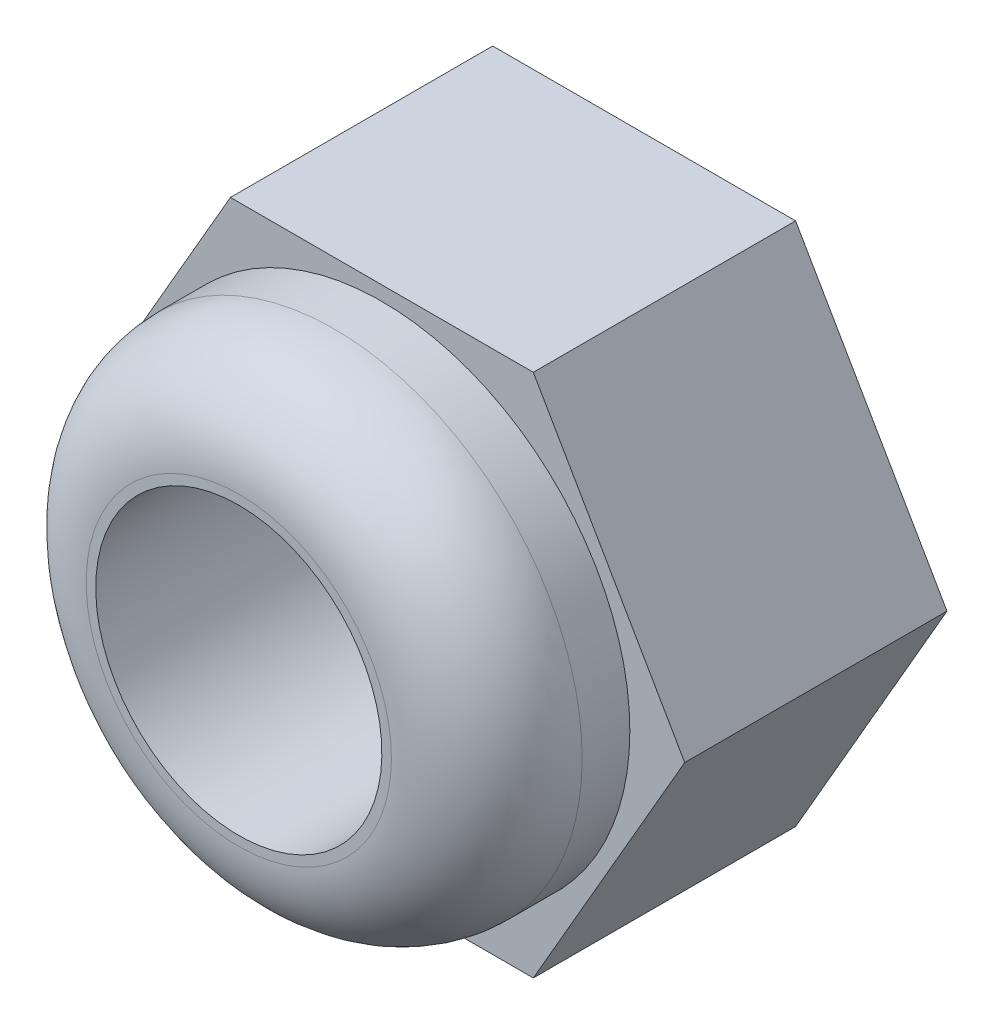
ISO-10303-21;
HEADER;
FILE_DESCRIPTION(('STEP AP214'),'2;1');
FILE_NAME('part.step','',(''),(''),'','','');
FILE_SCHEMA(('AUTOMOTIVE_DESIGN { 1 0 10303 214 1 1 1 1 }'));
ENDSEC;
DATA;
#1=APPLICATION_CONTEXT('core data for automotive mechanical design processes');
#2=APPLICATION_PROTOCOL_DEFINITION('international standard','automotive_design',2000,#1);
#3=PRODUCT_CONTEXT('',#1,'mechanical');
#4=PRODUCT('Part','Part','',(#3));
#5=PRODUCT_RELATED_PRODUCT_CATEGORY('part','',(#4));
#6=PRODUCT_DEFINITION_FORMATION('','',#4);
#7=PRODUCT_DEFINITION_CONTEXT('part definition',#1,'design');
#8=PRODUCT_DEFINITION('design','',#6,#7);
#9=PRODUCT_DEFINITION_SHAPE('','',#8);
#10=(LENGTH_UNIT() NAMED_UNIT(*) SI_UNIT(.MILLI.,.METRE.));
#11=(NAMED_UNIT(*) PLANE_ANGLE_UNIT() SI_UNIT($,.RADIAN.));
#12=(NAMED_UNIT(*) SI_UNIT($,.STERADIAN.) SOLID_ANGLE_UNIT());
#13=UNCERTAINTY_MEASURE_WITH_UNIT(LENGTH_MEASURE(1.E-05),#10,'distance_accuracy_value','');
#14=(GEOMETRIC_REPRESENTATION_CONTEXT(3) GLOBAL_UNCERTAINTY_ASSIGNED_CONTEXT((#13)) GLOBAL_UNIT_ASSIGNED_CONTEXT((#10,
#11,#12)) REPRESENTATION_CONTEXT('',''));
#15=CARTESIAN_POINT('',(0.,0.,0.));
#16=DIRECTION('',(0.,0.,1.));
#17=DIRECTION('',(1.,0.,0.));
#18=AXIS2_PLACEMENT_3D('',#15,#16,#17);
#19=CARTESIAN_POINT('',(-1.58771324027147,-2.75,0.));
#20=DIRECTION('',(0.,-1.,0.));
#21=DIRECTION('',(1.,0.,0.));
#22=AXIS2_PLACEMENT_3D('',#19,#20,#21);
#23=PLANE('',#22);
#24=DIRECTION('',(1.,0.,0.));
#25=VECTOR('',#24,1.);
#26=CARTESIAN_POINT('',(-1.58771324027147,-2.75,2.75));
#27=LINE('',#26,#25);
#28=CARTESIAN_POINT('',(-1.58771324027147,-2.75,2.75));
#29=VERTEX_POINT('',#28);
#30=CARTESIAN_POINT('',(1.58771324027147,-2.75,2.75));
#31=VERTEX_POINT('',#30);
#32=EDGE_CURVE('E120',#29,#31,#27,.T.);
#33=ORIENTED_EDGE('',*,*,#32,.F.);
#34=DIRECTION('',(0.,0.,1.));
#35=VECTOR('',#34,1.);
#36=CARTESIAN_POINT('',(-1.58771324027147,-2.75,0.));
#37=LINE('',#36,#35);
#38=CARTESIAN_POINT('',(-1.58771324027147,-2.75,0.));
#39=VERTEX_POINT('',#38);
#40=EDGE_CURVE('E49',#39,#29,#37,.T.);
#41=ORIENTED_EDGE('',*,*,#40,.F.);
#42=DIRECTION('',(1.,0.,0.));
#43=VECTOR('',#42,1.);
#44=CARTESIAN_POINT('',(-1.58771324027147,-2.75,0.));
#45=LINE('',#44,#43);
#46=CARTESIAN_POINT('',(1.58771324027147,-2.75,0.));
#47=VERTEX_POINT('',#46);
#48=EDGE_CURVE('E136',#39,#47,#45,.T.);
#49=ORIENTED_EDGE('',*,*,#48,.T.);
#50=DIRECTION('',(0.,0.,1.));
#51=VECTOR('',#50,1.);
#52=CARTESIAN_POINT('',(1.58771324027147,-2.75,0.));
#53=LINE('',#52,#51);
#54=EDGE_CURVE('E84',#47,#31,#53,.T.);
#55=ORIENTED_EDGE('',*,*,#54,.T.);
#56=EDGE_LOOP('',(#33,#41,#49,#55));
#57=FACE_BOUND('',#56,.T.);
#58=ADVANCED_FACE('F32',(#57),#23,.T.);
#59=CARTESIAN_POINT('',(-3.17542648054294,0.,0.));
#60=DIRECTION('',(-0.866025403784438,-0.500000000000001,0.));
#61=DIRECTION('',(0.500000000000001,-0.866025403784438,0.));
#62=AXIS2_PLACEMENT_3D('',#59,#60,#61);
#63=PLANE('',#62);
#64=DIRECTION('',(0.500000000000001,-0.866025403784438,0.));
#65=VECTOR('',#64,1.);
#66=CARTESIAN_POINT('',(-3.17542648054294,0.,2.75));
#67=LINE('',#66,#65);
#68=CARTESIAN_POINT('',(-3.17542648054294,0.,2.75));
#69=VERTEX_POINT('',#68);
#70=EDGE_CURVE('E133',#69,#29,#67,.T.);
#71=ORIENTED_EDGE('',*,*,#70,.F.);
#72=DIRECTION('',(0.,0.,1.));
#73=VECTOR('',#72,1.);
#74=CARTESIAN_POINT('',(-3.17542648054294,0.,0.));
#75=LINE('',#74,#73);
#76=CARTESIAN_POINT('',(-3.17542648054294,0.,0.));
#77=VERTEX_POINT('',#76);
#78=EDGE_CURVE('E72',#77,#69,#75,.T.);
#79=ORIENTED_EDGE('',*,*,#78,.F.);
#80=DIRECTION('',(0.500000000000001,-0.866025403784438,0.));
#81=VECTOR('',#80,1.);
#82=CARTESIAN_POINT('',(-3.17542648054294,0.,0.));
#83=LINE('',#82,#81);
#84=EDGE_CURVE('E110',#77,#39,#83,.T.);
#85=ORIENTED_EDGE('',*,*,#84,.T.);
#86=ORIENTED_EDGE('',*,*,#40,.T.);
#87=EDGE_LOOP('',(#71,#79,#85,#86));
#88=FACE_BOUND('',#87,.T.);
#89=ADVANCED_FACE('F161',(#88),#63,.T.);
#90=CARTESIAN_POINT('',(-1.58771324027147,2.75,0.));
#91=DIRECTION('',(-0.866025403784439,0.499999999999999,0.));
#92=DIRECTION('',(-0.499999999999999,-0.866025403784439,0.));
#93=AXIS2_PLACEMENT_3D('',#90,#91,#92);
#94=PLANE('',#93);
#95=DIRECTION('',(-0.499999999999999,-0.866025403784439,0.));
#96=VECTOR('',#95,1.);
#97=CARTESIAN_POINT('',(-1.58771324027147,2.75,2.75));
#98=LINE('',#97,#96);
#99=CARTESIAN_POINT('',(-1.58771324027147,2.75,2.75));
#100=VERTEX_POINT('',#99);
#101=EDGE_CURVE('E97',#100,#69,#98,.T.);
#102=ORIENTED_EDGE('',*,*,#101,.F.);
#103=DIRECTION('',(0.,0.,1.));
#104=VECTOR('',#103,1.);
#105=CARTESIAN_POINT('',(-1.58771324027147,2.75,0.));
#106=LINE('',#105,#104);
#107=CARTESIAN_POINT('',(-1.58771324027147,2.75,0.));
#108=VERTEX_POINT('',#107);
#109=EDGE_CURVE('E92',#108,#100,#106,.T.);
#110=ORIENTED_EDGE('',*,*,#109,.F.);
#111=DIRECTION('',(-0.499999999999999,-0.866025403784439,0.));
#112=VECTOR('',#111,1.);
#113=CARTESIAN_POINT('',(-1.58771324027147,2.75,0.));
#114=LINE('',#113,#112);
#115=EDGE_CURVE('E95',#108,#77,#114,.T.);
#116=ORIENTED_EDGE('',*,*,#115,.T.);
#117=ORIENTED_EDGE('',*,*,#78,.T.);
#118=EDGE_LOOP('',(#102,#110,#116,#117));
#119=FACE_BOUND('',#118,.T.);
#120=ADVANCED_FACE('F94',(#119),#94,.T.);
#121=CARTESIAN_POINT('',(1.58771324027147,2.75,0.));
#122=DIRECTION('',(0.,1.,0.));
#123=DIRECTION('',(-1.,0.,0.));
#124=AXIS2_PLACEMENT_3D('',#121,#122,#123);
#125=PLANE('',#124);
#126=DIRECTION('',(-1.,0.,0.));
#127=VECTOR('',#126,1.);
#128=CARTESIAN_POINT('',(1.58771324027147,2.75,2.75));
#129=LINE('',#128,#127);
#130=CARTESIAN_POINT('',(1.58771324027147,2.75,2.75));
#131=VERTEX_POINT('',#130);
#132=EDGE_CURVE('E130',#131,#100,#129,.T.);
#133=ORIENTED_EDGE('',*,*,#132,.F.);
#134=DIRECTION('',(0.,0.,1.));
#135=VECTOR('',#134,1.);
#136=CARTESIAN_POINT('',(1.58771324027147,2.75,0.));
#137=LINE('',#136,#135);
#138=CARTESIAN_POINT('',(1.58771324027147,2.75,0.));
#139=VERTEX_POINT('',#138);
#140=EDGE_CURVE('E102',#139,#131,#137,.T.);
#141=ORIENTED_EDGE('',*,*,#140,.F.);
#142=DIRECTION('',(-1.,0.,0.));
#143=VECTOR('',#142,1.);
#144=CARTESIAN_POINT('',(1.58771324027147,2.75,0.));
#145=LINE('',#144,#143);
#146=EDGE_CURVE('E108',#139,#108,#145,.T.);
#147=ORIENTED_EDGE('',*,*,#146,.T.);
#148=ORIENTED_EDGE('',*,*,#109,.T.);
#149=EDGE_LOOP('',(#133,#141,#147,#148));
#150=FACE_BOUND('',#149,.T.);
#151=ADVANCED_FACE('F112',(#150),#125,.T.);
#152=CARTESIAN_POINT('',(3.17542648054294,0.,0.));
#153=DIRECTION('',(0.866025403784438,0.500000000000001,0.));
#154=DIRECTION('',(-0.500000000000001,0.866025403784438,0.));
#155=AXIS2_PLACEMENT_3D('',#152,#153,#154);
#156=PLANE('',#155);
#157=DIRECTION('',(-0.500000000000001,0.866025403784438,0.));
#158=VECTOR('',#157,1.);
#159=CARTESIAN_POINT('',(3.17542648054294,0.,2.75));
#160=LINE('',#159,#158);
#161=CARTESIAN_POINT('',(3.17542648054294,0.,2.75));
#162=VERTEX_POINT('',#161);
#163=EDGE_CURVE('E127',#162,#131,#160,.T.);
#164=ORIENTED_EDGE('',*,*,#163,.F.);
#165=DIRECTION('',(0.,0.,1.));
#166=VECTOR('',#165,1.);
#167=CARTESIAN_POINT('',(3.17542648054294,0.,0.));
#168=LINE('',#167,#166);
#169=CARTESIAN_POINT('',(3.17542648054294,0.,0.));
#170=VERTEX_POINT('',#169);
#171=EDGE_CURVE('E141',#170,#162,#168,.T.);
#172=ORIENTED_EDGE('',*,*,#171,.F.);
#173=DIRECTION('',(-0.500000000000001,0.866025403784438,0.));
#174=VECTOR('',#173,1.);
#175=CARTESIAN_POINT('',(3.17542648054294,0.,0.));
#176=LINE('',#175,#174);
#177=EDGE_CURVE('E113',#170,#139,#176,.T.);
#178=ORIENTED_EDGE('',*,*,#177,.T.);
#179=ORIENTED_EDGE('',*,*,#140,.T.);
#180=EDGE_LOOP('',(#164,#172,#178,#179));
#181=FACE_BOUND('',#180,.T.);
#182=ADVANCED_FACE('F170',(#181),#156,.T.);
#183=CARTESIAN_POINT('',(1.58771324027147,-2.75,0.));
#184=DIRECTION('',(0.866025403784439,-0.5,0.));
#185=DIRECTION('',(0.5,0.866025403784439,0.));
#186=AXIS2_PLACEMENT_3D('',#183,#184,#185);
#187=PLANE('',#186);
#188=DIRECTION('',(0.5,0.866025403784439,0.));
#189=VECTOR('',#188,1.);
#190=CARTESIAN_POINT('',(1.58771324027147,-2.75,2.75));
#191=LINE('',#190,#189);
#192=EDGE_CURVE('E123',#31,#162,#191,.T.);
#193=ORIENTED_EDGE('',*,*,#192,.F.);
#194=ORIENTED_EDGE('',*,*,#54,.F.);
#195=DIRECTION('',(0.5,0.866025403784439,0.));
#196=VECTOR('',#195,1.);
#197=CARTESIAN_POINT('',(1.58771324027147,-2.75,0.));
#198=LINE('',#197,#196);
#199=EDGE_CURVE('E115',#47,#170,#198,.T.);
#200=ORIENTED_EDGE('',*,*,#199,.T.);
#201=ORIENTED_EDGE('',*,*,#171,.T.);
#202=EDGE_LOOP('',(#193,#194,#200,#201));
#203=FACE_BOUND('',#202,.T.);
#204=ADVANCED_FACE('F167',(#203),#187,.T.);
#205=CARTESIAN_POINT('',(0.,0.,0.));
#206=DIRECTION('',(0.,0.,1.));
#207=DIRECTION('',(1.,0.,0.));
#208=AXIS2_PLACEMENT_3D('',#205,#206,#207);
#209=PLANE('',#208);
#210=CARTESIAN_POINT('',(0.,0.,0.));
#211=DIRECTION('',(0.,0.,-1.));
#212=DIRECTION('',(0.,1.,0.));
#213=AXIS2_PLACEMENT_3D('',#210,#211,#212);
#214=CIRCLE('',#213,1.49999999999998);
#215=CARTESIAN_POINT('',(0.,1.49999999999999,0.));
#216=VERTEX_POINT('',#215);
#217=EDGE_CURVE('E266',#216,#216,#214,.T.);
#218=ORIENTED_EDGE('',*,*,#217,.F.);
#219=EDGE_LOOP('',(#218));
#220=FACE_BOUND('',#219,.T.);
#221=ORIENTED_EDGE('',*,*,#48,.F.);
#222=ORIENTED_EDGE('',*,*,#84,.F.);
#223=ORIENTED_EDGE('',*,*,#115,.F.);
#224=ORIENTED_EDGE('',*,*,#146,.F.);
#225=ORIENTED_EDGE('',*,*,#177,.F.);
#226=ORIENTED_EDGE('',*,*,#199,.F.);
#227=EDGE_LOOP('',(#221,#222,#223,#224,#225,#226));
#228=FACE_BOUND('',#227,.T.);
#229=ADVANCED_FACE('F106',(#220,#228),#209,.F.);
#230=CARTESIAN_POINT('',(0.,0.,2.75));
#231=DIRECTION('',(0.,0.,1.));
#232=DIRECTION('',(1.,0.,0.));
#233=AXIS2_PLACEMENT_3D('',#230,#231,#232);
#234=PLANE('',#233);
#235=CARTESIAN_POINT('',(0.,0.,2.75));
#236=DIRECTION('',(0.,0.,1.));
#237=DIRECTION('',(1.,0.,0.));
#238=AXIS2_PLACEMENT_3D('',#235,#236,#237);
#239=CIRCLE('',#238,2.6);
#240=CARTESIAN_POINT('',(2.6,0.,2.75));
#241=VERTEX_POINT('',#240);
#242=EDGE_CURVE('E138',#241,#241,#239,.T.);
#243=ORIENTED_EDGE('',*,*,#242,.F.);
#244=EDGE_LOOP('',(#243));
#245=FACE_BOUND('',#244,.T.);
#246=ORIENTED_EDGE('',*,*,#32,.T.);
#247=ORIENTED_EDGE('',*,*,#192,.T.);
#248=ORIENTED_EDGE('',*,*,#163,.T.);
#249=ORIENTED_EDGE('',*,*,#132,.T.);
#250=ORIENTED_EDGE('',*,*,#101,.T.);
#251=ORIENTED_EDGE('',*,*,#70,.T.);
#252=EDGE_LOOP('',(#246,#247,#248,#249,#250,#251));
#253=FACE_BOUND('',#252,.T.);
#254=ADVANCED_FACE('F178',(#245,#253),#234,.T.);
#255=CARTESIAN_POINT('',(0.,0.,2.75));
#256=DIRECTION('',(0.,0.,1.));
#257=DIRECTION('',(1.,0.,0.));
#258=AXIS2_PLACEMENT_3D('',#255,#256,#257);
#259=CYLINDRICAL_SURFACE('',#258,2.6);
#260=CARTESIAN_POINT('',(0.,0.,3.25));
#261=DIRECTION('',(0.,0.,1.));
#262=DIRECTION('',(1.,0.,0.));
#263=AXIS2_PLACEMENT_3D('',#260,#261,#262);
#264=CIRCLE('',#263,2.6);
#265=CARTESIAN_POINT('',(2.6,0.,3.25));
#266=VERTEX_POINT('',#265);
#267=EDGE_CURVE('E11',#266,#266,#264,.F.);
#268=ORIENTED_EDGE('',*,*,#267,.T.);
#269=EDGE_LOOP('',(#268));
#270=FACE_BOUND('',#269,.T.);
#271=ORIENTED_EDGE('',*,*,#242,.T.);
#272=EDGE_LOOP('',(#271));
#273=FACE_BOUND('',#272,.T.);
#274=ADVANCED_FACE('F181',(#270,#273),#259,.T.);
#275=CARTESIAN_POINT('',(0.,0.,4.25));
#276=DIRECTION('',(0.,0.,1.));
#277=DIRECTION('',(1.,0.,0.));
#278=AXIS2_PLACEMENT_3D('',#275,#276,#277);
#279=PLANE('',#278);
#280=CARTESIAN_POINT('',(0.,0.,4.25));
#281=DIRECTION('',(0.,0.,1.));
#282=DIRECTION('',(1.,0.,0.));
#283=AXIS2_PLACEMENT_3D('',#280,#281,#282);
#284=CIRCLE('',#283,1.6);
#285=CARTESIAN_POINT('',(1.6,0.,4.25));
#286=VERTEX_POINT('',#285);
#287=EDGE_CURVE('E41',#286,#286,#284,.T.);
#288=ORIENTED_EDGE('',*,*,#287,.T.);
#289=EDGE_LOOP('',(#288));
#290=FACE_BOUND('',#289,.T.);
#291=CARTESIAN_POINT('',(0.,0.,4.25));
#292=DIRECTION('',(0.,0.,-1.));
#293=DIRECTION('',(0.,1.,0.));
#294=AXIS2_PLACEMENT_3D('',#291,#292,#293);
#295=CIRCLE('',#294,1.49999999999998);
#296=CARTESIAN_POINT('',(0.,1.49999999999999,4.25));
#297=VERTEX_POINT('',#296);
#298=EDGE_CURVE('E124',#297,#297,#295,.T.);
#299=ORIENTED_EDGE('',*,*,#298,.T.);
#300=EDGE_LOOP('',(#299));
#301=FACE_BOUND('',#300,.T.);
#302=ADVANCED_FACE('F148',(#290,#301),#279,.T.);
#303=CARTESIAN_POINT('',(0.,0.,0.));
#304=DIRECTION('',(0.,0.,-1.));
#305=DIRECTION('',(0.,1.,0.));
#306=AXIS2_PLACEMENT_3D('',#303,#304,#305);
#307=CYLINDRICAL_SURFACE('',#306,1.49999999999998);
#308=ORIENTED_EDGE('',*,*,#298,.F.);
#309=EDGE_LOOP('',(#308));
#310=FACE_BOUND('',#309,.T.);
#311=ORIENTED_EDGE('',*,*,#217,.T.);
#312=EDGE_LOOP('',(#311));
#313=FACE_BOUND('',#312,.T.);
#314=ADVANCED_FACE('F152',(#310,#313),#307,.F.);
#315=CARTESIAN_POINT('',(0.,0.,3.25));
#316=DIRECTION('',(0.,0.,1.));
#317=DIRECTION('',(1.,0.,0.));
#318=AXIS2_PLACEMENT_3D('',#315,#316,#317);
#319=TOROIDAL_SURFACE('',#318,1.6,1.);
#320=ORIENTED_EDGE('',*,*,#267,.F.);
#321=EDGE_LOOP('',(#320));
#322=FACE_BOUND('',#321,.T.);
#323=ORIENTED_EDGE('',*,*,#287,.F.);
#324=EDGE_LOOP('',(#323));
#325=FACE_BOUND('',#324,.T.);
#326=ADVANCED_FACE('F34',(#322,#325),#319,.T.);
#327=CLOSED_SHELL('',(#58,#89,#120,#151,#182,#204,#229,#254,#274,#302,#314,#326));
#328=MANIFOLD_SOLID_BREP('B2',#327);
#329=ADVANCED_BREP_SHAPE_REPRESENTATION('',(#18,#328),#14);
#330=SHAPE_DEFINITION_REPRESENTATION(#9,#329);
ENDSEC;
END-ISO-10303-21;
